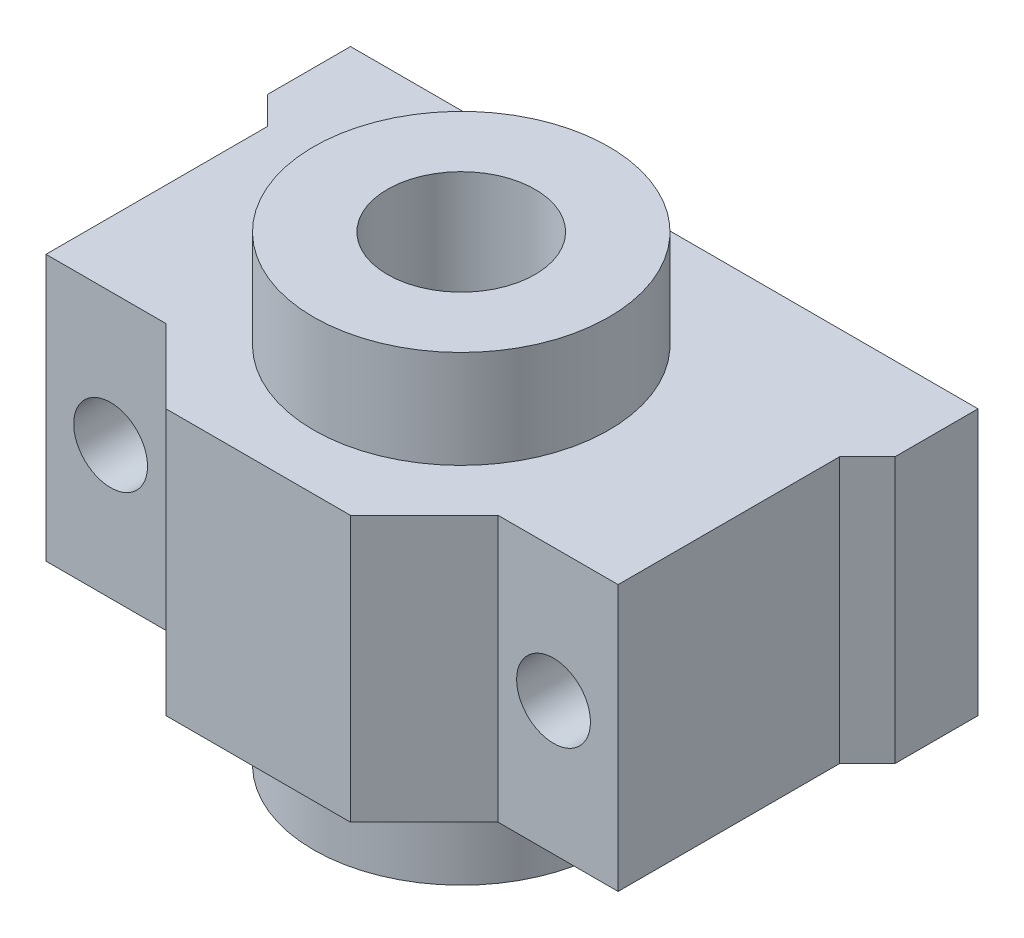
ISO-10303-21;
HEADER;
FILE_DESCRIPTION(('STEP AP214'),'2;1');
FILE_NAME('part.step','',(''),(''),'','','');
FILE_SCHEMA(('AUTOMOTIVE_DESIGN { 1 0 10303 214 1 1 1 1 }'));
ENDSEC;
DATA;
#1=APPLICATION_CONTEXT('core data for automotive mechanical design processes');
#2=APPLICATION_PROTOCOL_DEFINITION('international standard','automotive_design',2000,#1);
#3=PRODUCT_CONTEXT('',#1,'mechanical');
#4=PRODUCT('Part','Part','',(#3));
#5=PRODUCT_RELATED_PRODUCT_CATEGORY('part','',(#4));
#6=PRODUCT_DEFINITION_FORMATION('','',#4);
#7=PRODUCT_DEFINITION_CONTEXT('part definition',#1,'design');
#8=PRODUCT_DEFINITION('design','',#6,#7);
#9=PRODUCT_DEFINITION_SHAPE('','',#8);
#10=(LENGTH_UNIT() NAMED_UNIT(*) SI_UNIT(.MILLI.,.METRE.));
#11=(NAMED_UNIT(*) PLANE_ANGLE_UNIT() SI_UNIT($,.RADIAN.));
#12=(NAMED_UNIT(*) SI_UNIT($,.STERADIAN.) SOLID_ANGLE_UNIT());
#13=UNCERTAINTY_MEASURE_WITH_UNIT(LENGTH_MEASURE(1.E-05),#10,'distance_accuracy_value','');
#14=(GEOMETRIC_REPRESENTATION_CONTEXT(3) GLOBAL_UNCERTAINTY_ASSIGNED_CONTEXT((#13)) GLOBAL_UNIT_ASSIGNED_CONTEXT((#10,
#11,#12)) REPRESENTATION_CONTEXT('',''));
#15=CARTESIAN_POINT('',(0.,0.,0.));
#16=DIRECTION('',(0.,0.,1.));
#17=DIRECTION('',(1.,0.,0.));
#18=AXIS2_PLACEMENT_3D('',#15,#16,#17);
#19=CARTESIAN_POINT('',(0.,7.2,0.));
#20=DIRECTION('',(0.,1.,0.));
#21=DIRECTION('',(0.,0.,1.));
#22=AXIS2_PLACEMENT_3D('',#19,#20,#21);
#23=PLANE('',#22);
#24=CARTESIAN_POINT('',(-68.4705882352941,7.2,-17.4117647058823));
#25=DIRECTION('',(0.,1.,0.));
#26=DIRECTION('',(0.,0.,1.));
#27=AXIS2_PLACEMENT_3D('',#24,#25,#26);
#28=CIRCLE('',#27,8.);
#29=CARTESIAN_POINT('',(-68.4705882352941,7.2,-9.41176470588227));
#30=VERTEX_POINT('',#29);
#31=EDGE_CURVE('E291',#30,#30,#28,.T.);
#32=ORIENTED_EDGE('',*,*,#31,.F.);
#33=EDGE_LOOP('',(#32));
#34=FACE_BOUND('',#33,.T.);
#35=DIRECTION('',(-1.,0.,0.));
#36=VECTOR('',#35,1.);
#37=CARTESIAN_POINT('',(-85.4705882352941,7.2,-28.4117647058823));
#38=LINE('',#37,#36);
#39=CARTESIAN_POINT('',(-51.4705882352941,7.2,-28.4117647058823));
#40=VERTEX_POINT('',#39);
#41=CARTESIAN_POINT('',(-85.4705882352941,7.2,-28.4117647058823));
#42=VERTEX_POINT('',#41);
#43=EDGE_CURVE('E297',#40,#42,#38,.T.);
#44=ORIENTED_EDGE('',*,*,#43,.T.);
#45=DIRECTION('',(0.,0.,1.));
#46=VECTOR('',#45,1.);
#47=CARTESIAN_POINT('',(-85.4705882352941,7.2,-28.4117647058823));
#48=LINE('',#47,#46);
#49=CARTESIAN_POINT('',(-85.470588235294,7.2,-23.9117647058823));
#50=VERTEX_POINT('',#49);
#51=EDGE_CURVE('E300',#42,#50,#48,.T.);
#52=ORIENTED_EDGE('',*,*,#51,.T.);
#53=DIRECTION('',(0.70710678118655,0.,0.707106781186545));
#54=VECTOR('',#53,1.);
#55=CARTESIAN_POINT('',(-30.7794117647056,7.2,30.7794117647058));
#56=LINE('',#55,#54);
#57=CARTESIAN_POINT('',(-83.970588235294,7.2,-22.4117647058823));
#58=VERTEX_POINT('',#57);
#59=EDGE_CURVE('E141',#50,#58,#56,.T.);
#60=ORIENTED_EDGE('',*,*,#59,.T.);
#61=DIRECTION('',(0.,0.,1.));
#62=VECTOR('',#61,1.);
#63=CARTESIAN_POINT('',(-83.9705882352941,7.2,0.));
#64=LINE('',#63,#62);
#65=CARTESIAN_POINT('',(-83.9705882352941,7.2,-10.4117647058823));
#66=VERTEX_POINT('',#65);
#67=EDGE_CURVE('E281',#58,#66,#64,.T.);
#68=ORIENTED_EDGE('',*,*,#67,.T.);
#69=DIRECTION('',(1.,0.,0.));
#70=VECTOR('',#69,1.);
#71=CARTESIAN_POINT('',(0.,7.2,-10.4117647058823));
#72=LINE('',#71,#70);
#73=CARTESIAN_POINT('',(-77.470588235294,7.2,-10.4117647058823));
#74=VERTEX_POINT('',#73);
#75=EDGE_CURVE('E277',#66,#74,#72,.T.);
#76=ORIENTED_EDGE('',*,*,#75,.T.);
#77=DIRECTION('',(0.707106781186545,0.,0.70710678118655));
#78=VECTOR('',#77,1.);
#79=CARTESIAN_POINT('',(-33.5294117647061,7.2,33.5294117647059));
#80=LINE('',#79,#78);
#81=CARTESIAN_POINT('',(-73.4705882352941,7.2,-6.41176470588227));
#82=VERTEX_POINT('',#81);
#83=EDGE_CURVE('E260',#74,#82,#80,.T.);
#84=ORIENTED_EDGE('',*,*,#83,.T.);
#85=DIRECTION('',(1.,0.,0.));
#86=VECTOR('',#85,1.);
#87=CARTESIAN_POINT('',(-85.4705882352941,7.2,-6.41176470588227));
#88=LINE('',#87,#86);
#89=CARTESIAN_POINT('',(-63.4705882352941,7.2,-6.41176470588227));
#90=VERTEX_POINT('',#89);
#91=EDGE_CURVE('E180',#82,#90,#88,.T.);
#92=ORIENTED_EDGE('',*,*,#91,.T.);
#93=DIRECTION('',(-0.707106781186545,0.,0.70710678118655));
#94=VECTOR('',#93,1.);
#95=CARTESIAN_POINT('',(-34.9411764705884,7.2,-34.9411764705881));
#96=LINE('',#95,#94);
#97=CARTESIAN_POINT('',(-59.4705882352941,7.2,-10.4117647058823));
#98=VERTEX_POINT('',#97);
#99=EDGE_CURVE('E57',#98,#90,#96,.T.);
#100=ORIENTED_EDGE('',*,*,#99,.F.);
#101=DIRECTION('',(-1.,0.,0.));
#102=VECTOR('',#101,1.);
#103=CARTESIAN_POINT('',(0.,7.2,-10.4117647058822));
#104=LINE('',#103,#102);
#105=CARTESIAN_POINT('',(-52.9705882352941,7.2,-10.4117647058823));
#106=VERTEX_POINT('',#105);
#107=EDGE_CURVE('E288',#106,#98,#104,.T.);
#108=ORIENTED_EDGE('',*,*,#107,.F.);
#109=DIRECTION('',(0.,0.,1.));
#110=VECTOR('',#109,1.);
#111=CARTESIAN_POINT('',(-52.9705882352941,7.2,0.));
#112=LINE('',#111,#110);
#113=CARTESIAN_POINT('',(-52.9705882352941,7.2,-22.4117647058823));
#114=VERTEX_POINT('',#113);
#115=EDGE_CURVE('E285',#114,#106,#112,.T.);
#116=ORIENTED_EDGE('',*,*,#115,.F.);
#117=DIRECTION('',(-0.707106781186548,0.,0.707106781186547));
#118=VECTOR('',#117,1.);
#119=CARTESIAN_POINT('',(-37.6911764705881,7.2,-37.6911764705882));
#120=LINE('',#119,#118);
#121=CARTESIAN_POINT('',(-51.4705882352941,7.2,-23.9117647058823));
#122=VERTEX_POINT('',#121);
#123=EDGE_CURVE('E274',#122,#114,#120,.T.);
#124=ORIENTED_EDGE('',*,*,#123,.F.);
#125=DIRECTION('',(0.,0.,-1.));
#126=VECTOR('',#125,1.);
#127=CARTESIAN_POINT('',(-51.4705882352941,7.2,-28.4117647058823));
#128=LINE('',#127,#126);
#129=EDGE_CURVE('E171',#122,#40,#128,.T.);
#130=ORIENTED_EDGE('',*,*,#129,.T.);
#131=EDGE_LOOP('',(#44,#52,#60,#68,#76,#84,#92,#100,#108,#116,#124,#130));
#132=FACE_BOUND('',#131,.T.);
#133=ADVANCED_FACE('F39',(#34,#132),#23,.T.);
#134=CARTESIAN_POINT('',(0.,-7.2,0.));
#135=DIRECTION('',(0.,1.,0.));
#136=DIRECTION('',(0.,0.,1.));
#137=AXIS2_PLACEMENT_3D('',#134,#135,#136);
#138=PLANE('',#137);
#139=CARTESIAN_POINT('',(-68.4705882352941,-7.2,-17.4117647058823));
#140=DIRECTION('',(0.,1.,0.));
#141=DIRECTION('',(0.,0.,1.));
#142=AXIS2_PLACEMENT_3D('',#139,#140,#141);
#143=CIRCLE('',#142,8.);
#144=CARTESIAN_POINT('',(-68.4705882352941,-7.2,-9.41176470588227));
#145=VERTEX_POINT('',#144);
#146=EDGE_CURVE('E197',#145,#145,#143,.T.);
#147=ORIENTED_EDGE('',*,*,#146,.T.);
#148=EDGE_LOOP('',(#147));
#149=FACE_BOUND('',#148,.T.);
#150=DIRECTION('',(0.,0.,1.));
#151=VECTOR('',#150,1.);
#152=CARTESIAN_POINT('',(-85.4705882352941,-7.2,-28.4117647058823));
#153=LINE('',#152,#151);
#154=CARTESIAN_POINT('',(-85.4705882352941,-7.2,-28.4117647058823));
#155=VERTEX_POINT('',#154);
#156=CARTESIAN_POINT('',(-85.470588235294,-7.2,-23.9117647058823));
#157=VERTEX_POINT('',#156);
#158=EDGE_CURVE('E155',#155,#157,#153,.T.);
#159=ORIENTED_EDGE('',*,*,#158,.F.);
#160=DIRECTION('',(-1.,0.,0.));
#161=VECTOR('',#160,1.);
#162=CARTESIAN_POINT('',(-85.4705882352941,-7.2,-28.4117647058823));
#163=LINE('',#162,#161);
#164=CARTESIAN_POINT('',(-51.4705882352941,-7.2,-28.4117647058823));
#165=VERTEX_POINT('',#164);
#166=EDGE_CURVE('E166',#165,#155,#163,.T.);
#167=ORIENTED_EDGE('',*,*,#166,.F.);
#168=DIRECTION('',(0.,0.,-1.));
#169=VECTOR('',#168,1.);
#170=CARTESIAN_POINT('',(-51.4705882352941,-7.2,-28.4117647058823));
#171=LINE('',#170,#169);
#172=CARTESIAN_POINT('',(-51.4705882352941,-7.2,-23.9117647058823));
#173=VERTEX_POINT('',#172);
#174=EDGE_CURVE('E173',#173,#165,#171,.T.);
#175=ORIENTED_EDGE('',*,*,#174,.F.);
#176=DIRECTION('',(-0.707106781186548,0.,0.707106781186547));
#177=VECTOR('',#176,1.);
#178=CARTESIAN_POINT('',(-37.6911764705881,-7.2,-37.6911764705882));
#179=LINE('',#178,#177);
#180=CARTESIAN_POINT('',(-52.9705882352941,-7.2,-22.4117647058823));
#181=VERTEX_POINT('',#180);
#182=EDGE_CURVE('E270',#173,#181,#179,.T.);
#183=ORIENTED_EDGE('',*,*,#182,.T.);
#184=DIRECTION('',(0.,0.,1.));
#185=VECTOR('',#184,1.);
#186=CARTESIAN_POINT('',(-52.9705882352941,-7.2,0.));
#187=LINE('',#186,#185);
#188=CARTESIAN_POINT('',(-52.9705882352941,-7.2,-10.4117647058823));
#189=VERTEX_POINT('',#188);
#190=EDGE_CURVE('E49',#181,#189,#187,.T.);
#191=ORIENTED_EDGE('',*,*,#190,.T.);
#192=DIRECTION('',(-1.,0.,0.));
#193=VECTOR('',#192,1.);
#194=CARTESIAN_POINT('',(0.,-7.2,-10.4117647058822));
#195=LINE('',#194,#193);
#196=CARTESIAN_POINT('',(-59.4705882352941,-7.2,-10.4117647058823));
#197=VERTEX_POINT('',#196);
#198=EDGE_CURVE('E12',#189,#197,#195,.T.);
#199=ORIENTED_EDGE('',*,*,#198,.T.);
#200=DIRECTION('',(-0.707106781186545,0.,0.70710678118655));
#201=VECTOR('',#200,1.);
#202=CARTESIAN_POINT('',(-34.9411764705884,-7.2,-34.9411764705881));
#203=LINE('',#202,#201);
#204=CARTESIAN_POINT('',(-63.4705882352941,-7.2,-6.41176470588227));
#205=VERTEX_POINT('',#204);
#206=EDGE_CURVE('E263',#197,#205,#203,.T.);
#207=ORIENTED_EDGE('',*,*,#206,.T.);
#208=DIRECTION('',(1.,0.,0.));
#209=VECTOR('',#208,1.);
#210=CARTESIAN_POINT('',(-85.4705882352941,-7.2,-6.41176470588227));
#211=LINE('',#210,#209);
#212=CARTESIAN_POINT('',(-73.4705882352941,-7.2,-6.41176470588227));
#213=VERTEX_POINT('',#212);
#214=EDGE_CURVE('E165',#213,#205,#211,.T.);
#215=ORIENTED_EDGE('',*,*,#214,.F.);
#216=DIRECTION('',(0.707106781186545,0.,0.70710678118655));
#217=VECTOR('',#216,1.);
#218=CARTESIAN_POINT('',(-33.5294117647061,-7.2,33.5294117647059));
#219=LINE('',#218,#217);
#220=CARTESIAN_POINT('',(-77.470588235294,-7.2,-10.4117647058823));
#221=VERTEX_POINT('',#220);
#222=EDGE_CURVE('E65',#221,#213,#219,.T.);
#223=ORIENTED_EDGE('',*,*,#222,.F.);
#224=DIRECTION('',(1.,0.,0.));
#225=VECTOR('',#224,1.);
#226=CARTESIAN_POINT('',(0.,-7.2,-10.4117647058823));
#227=LINE('',#226,#225);
#228=CARTESIAN_POINT('',(-83.9705882352941,-7.2,-10.4117647058823));
#229=VERTEX_POINT('',#228);
#230=EDGE_CURVE('E210',#229,#221,#227,.T.);
#231=ORIENTED_EDGE('',*,*,#230,.F.);
#232=DIRECTION('',(0.,0.,1.));
#233=VECTOR('',#232,1.);
#234=CARTESIAN_POINT('',(-83.9705882352941,-7.2,0.));
#235=LINE('',#234,#233);
#236=CARTESIAN_POINT('',(-83.970588235294,-7.2,-22.4117647058823));
#237=VERTEX_POINT('',#236);
#238=EDGE_CURVE('E157',#237,#229,#235,.T.);
#239=ORIENTED_EDGE('',*,*,#238,.F.);
#240=DIRECTION('',(0.70710678118655,0.,0.707106781186545));
#241=VECTOR('',#240,1.);
#242=CARTESIAN_POINT('',(-30.7794117647056,-7.2,30.7794117647058));
#243=LINE('',#242,#241);
#244=EDGE_CURVE('E138',#157,#237,#243,.T.);
#245=ORIENTED_EDGE('',*,*,#244,.F.);
#246=EDGE_LOOP('',(#159,#167,#175,#183,#191,#199,#207,#215,#223,#231,#239,#245));
#247=FACE_BOUND('',#246,.T.);
#248=ADVANCED_FACE('F153',(#149,#247),#138,.F.);
#249=CARTESIAN_POINT('',(-85.4705882352941,7.2,-28.4117647058823));
#250=DIRECTION('',(1.,0.,0.));
#251=DIRECTION('',(0.,0.,-1.));
#252=AXIS2_PLACEMENT_3D('',#249,#250,#251);
#253=PLANE('',#252);
#254=DIRECTION('',(0.,1.,0.));
#255=VECTOR('',#254,1.);
#256=CARTESIAN_POINT('',(-85.470588235294,-12.5,-23.9117647058823));
#257=LINE('',#256,#255);
#258=EDGE_CURVE('E134',#157,#50,#257,.T.);
#259=ORIENTED_EDGE('',*,*,#258,.T.);
#260=ORIENTED_EDGE('',*,*,#51,.F.);
#261=DIRECTION('',(0.,-1.,0.));
#262=VECTOR('',#261,1.);
#263=CARTESIAN_POINT('',(-85.4705882352941,7.2,-28.4117647058823));
#264=LINE('',#263,#262);
#265=EDGE_CURVE('E163',#42,#155,#264,.T.);
#266=ORIENTED_EDGE('',*,*,#265,.T.);
#267=ORIENTED_EDGE('',*,*,#158,.T.);
#268=EDGE_LOOP('',(#259,#260,#266,#267));
#269=FACE_BOUND('',#268,.T.);
#270=ADVANCED_FACE('F161',(#269),#253,.F.);
#271=CARTESIAN_POINT('',(-85.4705882352941,7.2,-6.41176470588227));
#272=DIRECTION('',(0.,0.,-1.));
#273=DIRECTION('',(-1.,0.,0.));
#274=AXIS2_PLACEMENT_3D('',#271,#272,#273);
#275=PLANE('',#274);
#276=ORIENTED_EDGE('',*,*,#214,.T.);
#277=DIRECTION('',(0.,1.,0.));
#278=VECTOR('',#277,1.);
#279=CARTESIAN_POINT('',(-63.4705882352941,7.2,-6.41176470588227));
#280=LINE('',#279,#278);
#281=EDGE_CURVE('E207',#205,#90,#280,.T.);
#282=ORIENTED_EDGE('',*,*,#281,.T.);
#283=ORIENTED_EDGE('',*,*,#91,.F.);
#284=DIRECTION('',(0.,1.,0.));
#285=VECTOR('',#284,1.);
#286=CARTESIAN_POINT('',(-73.4705882352941,7.2,-6.41176470588227));
#287=LINE('',#286,#285);
#288=EDGE_CURVE('E204',#213,#82,#287,.T.);
#289=ORIENTED_EDGE('',*,*,#288,.F.);
#290=EDGE_LOOP('',(#276,#282,#283,#289));
#291=FACE_BOUND('',#290,.T.);
#292=ADVANCED_FACE('F332',(#291),#275,.F.);
#293=CARTESIAN_POINT('',(-68.4705882352941,12.5,-17.4117647058823));
#294=DIRECTION('',(0.,-1.,0.));
#295=DIRECTION('',(0.,0.,-1.));
#296=AXIS2_PLACEMENT_3D('',#293,#294,#295);
#297=CYLINDRICAL_SURFACE('',#296,8.);
#298=CARTESIAN_POINT('',(-68.4705882352941,-12.5,-17.4117647058823));
#299=DIRECTION('',(0.,1.,0.));
#300=DIRECTION('',(0.,0.,1.));
#301=AXIS2_PLACEMENT_3D('',#298,#299,#300);
#302=CIRCLE('',#301,8.);
#303=CARTESIAN_POINT('',(-68.4705882352941,-12.5,-9.41176470588227));
#304=VERTEX_POINT('',#303);
#305=EDGE_CURVE('E189',#304,#304,#302,.T.);
#306=ORIENTED_EDGE('',*,*,#305,.T.);
#307=EDGE_LOOP('',(#306));
#308=FACE_BOUND('',#307,.T.);
#309=ORIENTED_EDGE('',*,*,#146,.F.);
#310=EDGE_LOOP('',(#309));
#311=FACE_BOUND('',#310,.T.);
#312=ADVANCED_FACE('F359',(#308,#311),#297,.T.);
#313=CARTESIAN_POINT('',(-68.4705882352941,12.5,-17.4117647058823));
#314=DIRECTION('',(0.,1.,0.));
#315=DIRECTION('',(0.,0.,1.));
#316=AXIS2_PLACEMENT_3D('',#313,#314,#315);
#317=PLANE('',#316);
#318=CARTESIAN_POINT('',(-68.4705882352941,12.5,-17.4117647058823));
#319=DIRECTION('',(0.,1.,0.));
#320=DIRECTION('',(0.,0.,1.));
#321=AXIS2_PLACEMENT_3D('',#318,#319,#320);
#322=CIRCLE('',#321,8.);
#323=CARTESIAN_POINT('',(-68.4705882352941,12.5,-9.41176470588227));
#324=VERTEX_POINT('',#323);
#325=EDGE_CURVE('E193',#324,#324,#322,.T.);
#326=ORIENTED_EDGE('',*,*,#325,.T.);
#327=EDGE_LOOP('',(#326));
#328=FACE_BOUND('',#327,.T.);
#329=CARTESIAN_POINT('',(-68.4705882352941,12.5,-17.4117647058823));
#330=DIRECTION('',(0.,1.,0.));
#331=DIRECTION('',(0.,0.,1.));
#332=AXIS2_PLACEMENT_3D('',#329,#330,#331);
#333=CIRCLE('',#332,4.00000000000001);
#334=CARTESIAN_POINT('',(-68.4705882352941,12.5,-13.4117647058823));
#335=VERTEX_POINT('',#334);
#336=EDGE_CURVE('E185',#335,#335,#333,.T.);
#337=ORIENTED_EDGE('',*,*,#336,.F.);
#338=EDGE_LOOP('',(#337));
#339=FACE_BOUND('',#338,.T.);
#340=ADVANCED_FACE('F372',(#328,#339),#317,.T.);
#341=CARTESIAN_POINT('',(-68.4705882352941,-12.5,-17.4117647058823));
#342=DIRECTION('',(0.,1.,0.));
#343=DIRECTION('',(0.,0.,1.));
#344=AXIS2_PLACEMENT_3D('',#341,#342,#343);
#345=PLANE('',#344);
#346=ORIENTED_EDGE('',*,*,#305,.F.);
#347=EDGE_LOOP('',(#346));
#348=FACE_BOUND('',#347,.T.);
#349=CARTESIAN_POINT('',(-68.4705882352941,-12.5,-17.4117647058823));
#350=DIRECTION('',(0.,1.,0.));
#351=DIRECTION('',(0.,0.,1.));
#352=AXIS2_PLACEMENT_3D('',#349,#350,#351);
#353=CIRCLE('',#352,4.00000000000001);
#354=CARTESIAN_POINT('',(-68.4705882352941,-12.5,-13.4117647058823));
#355=VERTEX_POINT('',#354);
#356=EDGE_CURVE('E184',#355,#355,#353,.T.);
#357=ORIENTED_EDGE('',*,*,#356,.T.);
#358=EDGE_LOOP('',(#357));
#359=FACE_BOUND('',#358,.T.);
#360=ADVANCED_FACE('F374',(#348,#359),#345,.F.);
#361=ORIENTED_EDGE('',*,*,#31,.T.);
#362=EDGE_LOOP('',(#361));
#363=FACE_BOUND('',#362,.T.);
#364=ORIENTED_EDGE('',*,*,#325,.F.);
#365=EDGE_LOOP('',(#364));
#366=FACE_BOUND('',#365,.T.);
#367=ADVANCED_FACE('F41',(#363,#366),#297,.T.);
#368=CARTESIAN_POINT('',(-68.4705882352941,12.5,-17.4117647058823));
#369=DIRECTION('',(0.,-1.,0.));
#370=DIRECTION('',(0.,0.,-1.));
#371=AXIS2_PLACEMENT_3D('',#368,#369,#370);
#372=CYLINDRICAL_SURFACE('',#371,4.00000000000001);
#373=ORIENTED_EDGE('',*,*,#336,.T.);
#374=EDGE_LOOP('',(#373));
#375=FACE_BOUND('',#374,.T.);
#376=ORIENTED_EDGE('',*,*,#356,.F.);
#377=EDGE_LOOP('',(#376));
#378=FACE_BOUND('',#377,.T.);
#379=ADVANCED_FACE('F368',(#375,#378),#372,.F.);
#380=CARTESIAN_POINT('',(-51.4705882352941,7.2,-28.4117647058823));
#381=DIRECTION('',(-1.,0.,0.));
#382=DIRECTION('',(0.,0.,1.));
#383=AXIS2_PLACEMENT_3D('',#380,#381,#382);
#384=PLANE('',#383);
#385=ORIENTED_EDGE('',*,*,#129,.F.);
#386=DIRECTION('',(0.,1.,0.));
#387=VECTOR('',#386,1.);
#388=CARTESIAN_POINT('',(-51.4705882352941,-12.5,-23.9117647058823));
#389=LINE('',#388,#387);
#390=EDGE_CURVE('E147',#173,#122,#389,.T.);
#391=ORIENTED_EDGE('',*,*,#390,.F.);
#392=ORIENTED_EDGE('',*,*,#174,.T.);
#393=DIRECTION('',(0.,-1.,0.));
#394=VECTOR('',#393,1.);
#395=CARTESIAN_POINT('',(-51.4705882352941,7.2,-28.4117647058823));
#396=LINE('',#395,#394);
#397=EDGE_CURVE('E179',#40,#165,#396,.T.);
#398=ORIENTED_EDGE('',*,*,#397,.F.);
#399=EDGE_LOOP('',(#385,#391,#392,#398));
#400=FACE_BOUND('',#399,.T.);
#401=ADVANCED_FACE('F311',(#400),#384,.F.);
#402=CARTESIAN_POINT('',(-85.4705882352941,7.2,-28.4117647058823));
#403=DIRECTION('',(0.,0.,1.));
#404=DIRECTION('',(1.,0.,0.));
#405=AXIS2_PLACEMENT_3D('',#402,#403,#404);
#406=PLANE('',#405);
#407=CARTESIAN_POINT('',(-80.4705882352941,0.,-28.4117647058823));
#408=DIRECTION('',(0.,0.,1.));
#409=DIRECTION('',(-1.,0.,0.));
#410=AXIS2_PLACEMENT_3D('',#407,#408,#409);
#411=CIRCLE('',#410,2.);
#412=CARTESIAN_POINT('',(-82.4705882352941,0.,-28.4117647058823));
#413=VERTEX_POINT('',#412);
#414=EDGE_CURVE('E228',#413,#413,#411,.T.);
#415=ORIENTED_EDGE('',*,*,#414,.T.);
#416=EDGE_LOOP('',(#415));
#417=FACE_BOUND('',#416,.T.);
#418=CARTESIAN_POINT('',(-56.4705882352941,0.,-28.4117647058823));
#419=DIRECTION('',(0.,0.,1.));
#420=DIRECTION('',(1.,0.,0.));
#421=AXIS2_PLACEMENT_3D('',#418,#419,#420);
#422=CIRCLE('',#421,2.);
#423=CARTESIAN_POINT('',(-54.4705882352941,0.,-28.4117647058823));
#424=VERTEX_POINT('',#423);
#425=EDGE_CURVE('E220',#424,#424,#422,.T.);
#426=ORIENTED_EDGE('',*,*,#425,.T.);
#427=EDGE_LOOP('',(#426));
#428=FACE_BOUND('',#427,.T.);
#429=ORIENTED_EDGE('',*,*,#166,.T.);
#430=ORIENTED_EDGE('',*,*,#265,.F.);
#431=ORIENTED_EDGE('',*,*,#43,.F.);
#432=ORIENTED_EDGE('',*,*,#397,.T.);
#433=EDGE_LOOP('',(#429,#430,#431,#432));
#434=FACE_BOUND('',#433,.T.);
#435=ADVANCED_FACE('F314',(#417,#428,#434),#406,.F.);
#436=CARTESIAN_POINT('',(-83.9705882352941,-12.5,0.));
#437=DIRECTION('',(-1.,0.,0.));
#438=DIRECTION('',(0.,0.,1.));
#439=AXIS2_PLACEMENT_3D('',#436,#437,#438);
#440=PLANE('',#439);
#441=DIRECTION('',(0.,1.,0.));
#442=VECTOR('',#441,1.);
#443=CARTESIAN_POINT('',(-83.970588235294,-12.5,-22.4117647058823));
#444=LINE('',#443,#442);
#445=EDGE_CURVE('E148',#237,#58,#444,.T.);
#446=ORIENTED_EDGE('',*,*,#445,.F.);
#447=ORIENTED_EDGE('',*,*,#238,.T.);
#448=DIRECTION('',(0.,1.,0.));
#449=VECTOR('',#448,1.);
#450=CARTESIAN_POINT('',(-83.9705882352941,-12.5,-10.4117647058823));
#451=LINE('',#450,#449);
#452=EDGE_CURVE('E251',#229,#66,#451,.T.);
#453=ORIENTED_EDGE('',*,*,#452,.T.);
#454=ORIENTED_EDGE('',*,*,#67,.F.);
#455=EDGE_LOOP('',(#446,#447,#453,#454));
#456=FACE_BOUND('',#455,.T.);
#457=ADVANCED_FACE('F364',(#456),#440,.T.);
#458=CARTESIAN_POINT('',(0.,-12.5,-10.4117647058823));
#459=DIRECTION('',(0.,0.,1.));
#460=DIRECTION('',(1.,0.,0.));
#461=AXIS2_PLACEMENT_3D('',#458,#459,#460);
#462=PLANE('',#461);
#463=CARTESIAN_POINT('',(-80.4705882352941,0.,-10.4117647058823));
#464=DIRECTION('',(0.,0.,1.));
#465=DIRECTION('',(1.,0.,0.));
#466=AXIS2_PLACEMENT_3D('',#463,#464,#465);
#467=CIRCLE('',#466,2.);
#468=CARTESIAN_POINT('',(-78.4705882352941,0.,-10.4117647058823));
#469=VERTEX_POINT('',#468);
#470=EDGE_CURVE('E43',#469,#469,#467,.T.);
#471=ORIENTED_EDGE('',*,*,#470,.F.);
#472=EDGE_LOOP('',(#471));
#473=FACE_BOUND('',#472,.T.);
#474=ORIENTED_EDGE('',*,*,#452,.F.);
#475=ORIENTED_EDGE('',*,*,#230,.T.);
#476=DIRECTION('',(0.,1.,0.));
#477=VECTOR('',#476,1.);
#478=CARTESIAN_POINT('',(-77.470588235294,-12.5,-10.4117647058823));
#479=LINE('',#478,#477);
#480=EDGE_CURVE('E226',#221,#74,#479,.T.);
#481=ORIENTED_EDGE('',*,*,#480,.T.);
#482=ORIENTED_EDGE('',*,*,#75,.F.);
#483=EDGE_LOOP('',(#474,#475,#481,#482));
#484=FACE_BOUND('',#483,.T.);
#485=ADVANCED_FACE('F335',(#473,#484),#462,.T.);
#486=CARTESIAN_POINT('',(-30.7794117647056,-12.5,30.7794117647058));
#487=DIRECTION('',(-0.707106781186545,0.,0.70710678118655));
#488=DIRECTION('',(0.70710678118655,0.,0.707106781186545));
#489=AXIS2_PLACEMENT_3D('',#486,#487,#488);
#490=PLANE('',#489);
#491=ORIENTED_EDGE('',*,*,#258,.F.);
#492=ORIENTED_EDGE('',*,*,#244,.T.);
#493=ORIENTED_EDGE('',*,*,#445,.T.);
#494=ORIENTED_EDGE('',*,*,#59,.F.);
#495=EDGE_LOOP('',(#491,#492,#493,#494));
#496=FACE_BOUND('',#495,.T.);
#497=ADVANCED_FACE('F136',(#496),#490,.T.);
#498=CARTESIAN_POINT('',(-33.5294117647061,-12.5,33.5294117647059));
#499=DIRECTION('',(-0.70710678118655,0.,0.707106781186545));
#500=DIRECTION('',(0.707106781186545,0.,0.70710678118655));
#501=AXIS2_PLACEMENT_3D('',#498,#499,#500);
#502=PLANE('',#501);
#503=ORIENTED_EDGE('',*,*,#480,.F.);
#504=ORIENTED_EDGE('',*,*,#222,.T.);
#505=ORIENTED_EDGE('',*,*,#288,.T.);
#506=ORIENTED_EDGE('',*,*,#83,.F.);
#507=EDGE_LOOP('',(#503,#504,#505,#506));
#508=FACE_BOUND('',#507,.T.);
#509=ADVANCED_FACE('F336',(#508),#502,.T.);
#510=CARTESIAN_POINT('',(0.,-12.5,-10.4117647058822));
#511=DIRECTION('',(0.,0.,-1.));
#512=DIRECTION('',(-1.,0.,0.));
#513=AXIS2_PLACEMENT_3D('',#510,#511,#512);
#514=PLANE('',#513);
#515=CARTESIAN_POINT('',(-56.4705882352941,0.,-10.4117647058823));
#516=DIRECTION('',(0.,0.,-1.));
#517=DIRECTION('',(-1.,0.,0.));
#518=AXIS2_PLACEMENT_3D('',#515,#516,#517);
#519=CIRCLE('',#518,2.);
#520=CARTESIAN_POINT('',(-58.4705882352941,0.,-10.4117647058823));
#521=VERTEX_POINT('',#520);
#522=EDGE_CURVE('E217',#521,#521,#519,.T.);
#523=ORIENTED_EDGE('',*,*,#522,.T.);
#524=EDGE_LOOP('',(#523));
#525=FACE_BOUND('',#524,.T.);
#526=ORIENTED_EDGE('',*,*,#107,.T.);
#527=DIRECTION('',(0.,1.,0.));
#528=VECTOR('',#527,1.);
#529=CARTESIAN_POINT('',(-59.4705882352941,-12.5,-10.4117647058823));
#530=LINE('',#529,#528);
#531=EDGE_CURVE('E236',#197,#98,#530,.T.);
#532=ORIENTED_EDGE('',*,*,#531,.F.);
#533=ORIENTED_EDGE('',*,*,#198,.F.);
#534=DIRECTION('',(0.,1.,0.));
#535=VECTOR('',#534,1.);
#536=CARTESIAN_POINT('',(-52.9705882352941,-12.5,-10.4117647058823));
#537=LINE('',#536,#535);
#538=EDGE_CURVE('E239',#189,#106,#537,.T.);
#539=ORIENTED_EDGE('',*,*,#538,.T.);
#540=EDGE_LOOP('',(#526,#532,#533,#539));
#541=FACE_BOUND('',#540,.T.);
#542=ADVANCED_FACE('F328',(#525,#541),#514,.F.);
#543=CARTESIAN_POINT('',(-52.9705882352941,-12.5,0.));
#544=DIRECTION('',(-1.,0.,0.));
#545=DIRECTION('',(0.,0.,1.));
#546=AXIS2_PLACEMENT_3D('',#543,#544,#545);
#547=PLANE('',#546);
#548=ORIENTED_EDGE('',*,*,#115,.T.);
#549=ORIENTED_EDGE('',*,*,#538,.F.);
#550=ORIENTED_EDGE('',*,*,#190,.F.);
#551=DIRECTION('',(0.,1.,0.));
#552=VECTOR('',#551,1.);
#553=CARTESIAN_POINT('',(-52.9705882352941,-12.5,-22.4117647058823));
#554=LINE('',#553,#552);
#555=EDGE_CURVE('E243',#181,#114,#554,.T.);
#556=ORIENTED_EDGE('',*,*,#555,.T.);
#557=EDGE_LOOP('',(#548,#549,#550,#556));
#558=FACE_BOUND('',#557,.T.);
#559=ADVANCED_FACE('F323',(#558),#547,.F.);
#560=CARTESIAN_POINT('',(-37.6911764705881,-12.5,-37.6911764705882));
#561=DIRECTION('',(-0.707106781186547,0.,-0.707106781186548));
#562=DIRECTION('',(-0.707106781186548,0.,0.707106781186547));
#563=AXIS2_PLACEMENT_3D('',#560,#561,#562);
#564=PLANE('',#563);
#565=ORIENTED_EDGE('',*,*,#123,.T.);
#566=ORIENTED_EDGE('',*,*,#555,.F.);
#567=ORIENTED_EDGE('',*,*,#182,.F.);
#568=ORIENTED_EDGE('',*,*,#390,.T.);
#569=EDGE_LOOP('',(#565,#566,#567,#568));
#570=FACE_BOUND('',#569,.T.);
#571=ADVANCED_FACE('F321',(#570),#564,.F.);
#572=CARTESIAN_POINT('',(-34.9411764705884,-12.5,-34.9411764705881));
#573=DIRECTION('',(-0.70710678118655,0.,-0.707106781186545));
#574=DIRECTION('',(-0.707106781186545,0.,0.70710678118655));
#575=AXIS2_PLACEMENT_3D('',#572,#573,#574);
#576=PLANE('',#575);
#577=ORIENTED_EDGE('',*,*,#99,.T.);
#578=ORIENTED_EDGE('',*,*,#281,.F.);
#579=ORIENTED_EDGE('',*,*,#206,.F.);
#580=ORIENTED_EDGE('',*,*,#531,.T.);
#581=EDGE_LOOP('',(#577,#578,#579,#580));
#582=FACE_BOUND('',#581,.T.);
#583=ADVANCED_FACE('F329',(#582),#576,.F.);
#584=CARTESIAN_POINT('',(-56.4705882352941,0.,-6.41176470588227));
#585=DIRECTION('',(0.,0.,1.));
#586=DIRECTION('',(1.,0.,0.));
#587=AXIS2_PLACEMENT_3D('',#584,#585,#586);
#588=CYLINDRICAL_SURFACE('',#587,2.);
#589=ORIENTED_EDGE('',*,*,#425,.F.);
#590=EDGE_LOOP('',(#589));
#591=FACE_BOUND('',#590,.T.);
#592=ORIENTED_EDGE('',*,*,#522,.F.);
#593=EDGE_LOOP('',(#592));
#594=FACE_BOUND('',#593,.T.);
#595=ADVANCED_FACE('F487',(#591,#594),#588,.F.);
#596=CARTESIAN_POINT('',(-80.4705882352941,0.,-6.41176470588227));
#597=DIRECTION('',(0.,0.,1.));
#598=DIRECTION('',(1.,0.,0.));
#599=AXIS2_PLACEMENT_3D('',#596,#597,#598);
#600=CYLINDRICAL_SURFACE('',#599,2.);
#601=ORIENTED_EDGE('',*,*,#470,.T.);
#602=EDGE_LOOP('',(#601));
#603=FACE_BOUND('',#602,.T.);
#604=ORIENTED_EDGE('',*,*,#414,.F.);
#605=EDGE_LOOP('',(#604));
#606=FACE_BOUND('',#605,.T.);
#607=ADVANCED_FACE('F494',(#603,#606),#600,.F.);
#608=CLOSED_SHELL('',(#133,#248,#270,#292,#312,#340,#360,#367,#379,#401,#435,#457,#485,#497,
#509,#542,#559,#571,#583,#595,#607));
#609=MANIFOLD_SOLID_BREP('B2',#608);
#610=ADVANCED_BREP_SHAPE_REPRESENTATION('',(#18,#609),#14);
#611=SHAPE_DEFINITION_REPRESENTATION(#9,#610);
ENDSEC;
END-ISO-10303-21;
